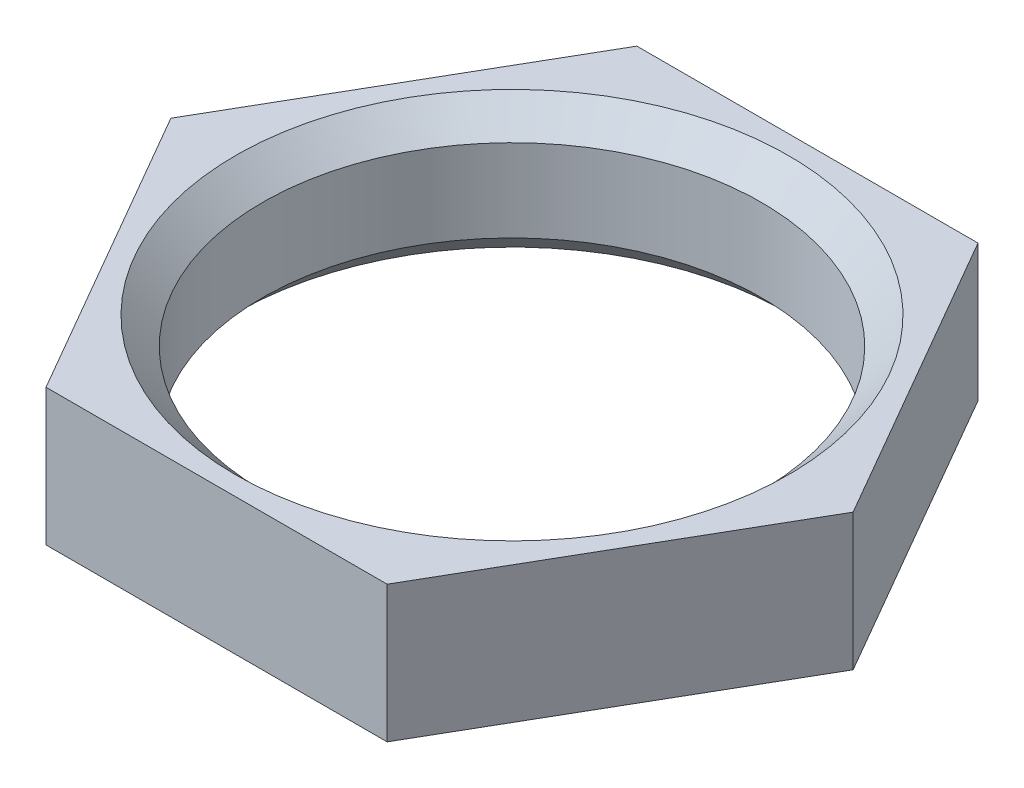
ISO-10303-21;
HEADER;
FILE_DESCRIPTION(('STEP AP214'),'2;1');
FILE_NAME('part.step','',(''),(''),'','','');
FILE_SCHEMA(('AUTOMOTIVE_DESIGN { 1 0 10303 214 1 1 1 1 }'));
ENDSEC;
DATA;
#1=APPLICATION_CONTEXT('core data for automotive mechanical design processes');
#2=APPLICATION_PROTOCOL_DEFINITION('international standard','automotive_design',2000,#1);
#3=PRODUCT_CONTEXT('',#1,'mechanical');
#4=PRODUCT('Part','Part','',(#3));
#5=PRODUCT_RELATED_PRODUCT_CATEGORY('part','',(#4));
#6=PRODUCT_DEFINITION_FORMATION('','',#4);
#7=PRODUCT_DEFINITION_CONTEXT('part definition',#1,'design');
#8=PRODUCT_DEFINITION('design','',#6,#7);
#9=PRODUCT_DEFINITION_SHAPE('','',#8);
#10=(LENGTH_UNIT() NAMED_UNIT(*) SI_UNIT(.MILLI.,.METRE.));
#11=(NAMED_UNIT(*) PLANE_ANGLE_UNIT() SI_UNIT($,.RADIAN.));
#12=(NAMED_UNIT(*) SI_UNIT($,.STERADIAN.) SOLID_ANGLE_UNIT());
#13=UNCERTAINTY_MEASURE_WITH_UNIT(LENGTH_MEASURE(1.E-05),#10,'distance_accuracy_value','');
#14=(GEOMETRIC_REPRESENTATION_CONTEXT(3) GLOBAL_UNCERTAINTY_ASSIGNED_CONTEXT((#13)) GLOBAL_UNIT_ASSIGNED_CONTEXT((#10,
#11,#12)) REPRESENTATION_CONTEXT('',''));
#15=CARTESIAN_POINT('',(0.,0.,0.));
#16=DIRECTION('',(0.,0.,1.));
#17=DIRECTION('',(1.,0.,0.));
#18=AXIS2_PLACEMENT_3D('',#15,#16,#17);
#19=CARTESIAN_POINT('',(3.20423625897551,2.5654,5.5499));
#20=DIRECTION('',(-0.866025403784439,0.,-0.5));
#21=DIRECTION('',(-0.5,0.,0.866025403784439));
#22=AXIS2_PLACEMENT_3D('',#19,#20,#21);
#23=PLANE('',#22);
#24=DIRECTION('',(0.5,0.,-0.866025403784439));
#25=VECTOR('',#24,1.);
#26=CARTESIAN_POINT('',(3.20423625897551,0.,5.5499));
#27=LINE('',#26,#25);
#28=CARTESIAN_POINT('',(3.20423625897551,0.,5.5499));
#29=VERTEX_POINT('',#28);
#30=CARTESIAN_POINT('',(6.40847251795101,0.,0.));
#31=VERTEX_POINT('',#30);
#32=EDGE_CURVE('E124',#29,#31,#27,.T.);
#33=ORIENTED_EDGE('',*,*,#32,.T.);
#34=DIRECTION('',(0.,-1.,0.));
#35=VECTOR('',#34,1.);
#36=CARTESIAN_POINT('',(6.40847251795101,2.5654,0.));
#37=LINE('',#36,#35);
#38=CARTESIAN_POINT('',(6.40847251795101,2.5654,0.));
#39=VERTEX_POINT('',#38);
#40=EDGE_CURVE('E141',#39,#31,#37,.T.);
#41=ORIENTED_EDGE('',*,*,#40,.F.);
#42=DIRECTION('',(0.5,0.,-0.866025403784439));
#43=VECTOR('',#42,1.);
#44=CARTESIAN_POINT('',(3.20423625897551,2.5654,5.5499));
#45=LINE('',#44,#43);
#46=CARTESIAN_POINT('',(3.20423625897551,2.5654,5.5499));
#47=VERTEX_POINT('',#46);
#48=EDGE_CURVE('E134',#47,#39,#45,.T.);
#49=ORIENTED_EDGE('',*,*,#48,.F.);
#50=DIRECTION('',(0.,-1.,0.));
#51=VECTOR('',#50,1.);
#52=CARTESIAN_POINT('',(3.20423625897551,2.5654,5.5499));
#53=LINE('',#52,#51);
#54=EDGE_CURVE('E120',#47,#29,#53,.T.);
#55=ORIENTED_EDGE('',*,*,#54,.T.);
#56=EDGE_LOOP('',(#33,#41,#49,#55));
#57=FACE_BOUND('',#56,.T.);
#58=ADVANCED_FACE('F38',(#57),#23,.F.);
#59=CARTESIAN_POINT('',(6.40847251795101,2.5654,0.));
#60=DIRECTION('',(-0.866025403784439,0.,0.5));
#61=DIRECTION('',(0.5,0.,0.866025403784439));
#62=AXIS2_PLACEMENT_3D('',#59,#60,#61);
#63=PLANE('',#62);
#64=DIRECTION('',(-0.5,0.,-0.866025403784438));
#65=VECTOR('',#64,1.);
#66=CARTESIAN_POINT('',(6.40847251795101,0.,0.));
#67=LINE('',#66,#65);
#68=CARTESIAN_POINT('',(3.2042362589755,0.,-5.5499));
#69=VERTEX_POINT('',#68);
#70=EDGE_CURVE('E127',#31,#69,#67,.T.);
#71=ORIENTED_EDGE('',*,*,#70,.T.);
#72=DIRECTION('',(0.,-1.,0.));
#73=VECTOR('',#72,1.);
#74=CARTESIAN_POINT('',(3.2042362589755,2.5654,-5.5499));
#75=LINE('',#74,#73);
#76=CARTESIAN_POINT('',(3.2042362589755,2.5654,-5.5499));
#77=VERTEX_POINT('',#76);
#78=EDGE_CURVE('E138',#77,#69,#75,.T.);
#79=ORIENTED_EDGE('',*,*,#78,.F.);
#80=DIRECTION('',(-0.5,0.,-0.866025403784438));
#81=VECTOR('',#80,1.);
#82=CARTESIAN_POINT('',(6.40847251795101,2.5654,0.));
#83=LINE('',#82,#81);
#84=EDGE_CURVE('E93',#39,#77,#83,.T.);
#85=ORIENTED_EDGE('',*,*,#84,.F.);
#86=ORIENTED_EDGE('',*,*,#40,.T.);
#87=EDGE_LOOP('',(#71,#79,#85,#86));
#88=FACE_BOUND('',#87,.T.);
#89=ADVANCED_FACE('F164',(#88),#63,.F.);
#90=CARTESIAN_POINT('',(3.2042362589755,2.5654,-5.5499));
#91=DIRECTION('',(0.,0.,1.));
#92=DIRECTION('',(1.,0.,0.));
#93=AXIS2_PLACEMENT_3D('',#90,#91,#92);
#94=PLANE('',#93);
#95=DIRECTION('',(-1.,0.,0.));
#96=VECTOR('',#95,1.);
#97=CARTESIAN_POINT('',(3.2042362589755,0.,-5.5499));
#98=LINE('',#97,#96);
#99=CARTESIAN_POINT('',(-3.20423625897551,0.,-5.5499));
#100=VERTEX_POINT('',#99);
#101=EDGE_CURVE('E129',#69,#100,#98,.T.);
#102=ORIENTED_EDGE('',*,*,#101,.T.);
#103=DIRECTION('',(0.,-1.,0.));
#104=VECTOR('',#103,1.);
#105=CARTESIAN_POINT('',(-3.20423625897551,2.5654,-5.5499));
#106=LINE('',#105,#104);
#107=CARTESIAN_POINT('',(-3.20423625897551,2.5654,-5.5499));
#108=VERTEX_POINT('',#107);
#109=EDGE_CURVE('E115',#108,#100,#106,.T.);
#110=ORIENTED_EDGE('',*,*,#109,.F.);
#111=DIRECTION('',(-1.,0.,0.));
#112=VECTOR('',#111,1.);
#113=CARTESIAN_POINT('',(3.2042362589755,2.5654,-5.5499));
#114=LINE('',#113,#112);
#115=EDGE_CURVE('E106',#77,#108,#114,.T.);
#116=ORIENTED_EDGE('',*,*,#115,.F.);
#117=ORIENTED_EDGE('',*,*,#78,.T.);
#118=EDGE_LOOP('',(#102,#110,#116,#117));
#119=FACE_BOUND('',#118,.T.);
#120=ADVANCED_FACE('F170',(#119),#94,.F.);
#121=CARTESIAN_POINT('',(-3.20423625897551,2.5654,-5.5499));
#122=DIRECTION('',(0.866025403784439,0.,0.5));
#123=DIRECTION('',(0.5,0.,-0.866025403784439));
#124=AXIS2_PLACEMENT_3D('',#121,#122,#123);
#125=PLANE('',#124);
#126=DIRECTION('',(-0.5,0.,0.866025403784439));
#127=VECTOR('',#126,1.);
#128=CARTESIAN_POINT('',(-3.20423625897551,0.,-5.5499));
#129=LINE('',#128,#127);
#130=CARTESIAN_POINT('',(-6.40847251795101,0.,0.));
#131=VERTEX_POINT('',#130);
#132=EDGE_CURVE('E114',#100,#131,#129,.T.);
#133=ORIENTED_EDGE('',*,*,#132,.T.);
#134=DIRECTION('',(0.,-1.,0.));
#135=VECTOR('',#134,1.);
#136=CARTESIAN_POINT('',(-6.40847251795101,2.5654,0.));
#137=LINE('',#136,#135);
#138=CARTESIAN_POINT('',(-6.40847251795101,2.5654,0.));
#139=VERTEX_POINT('',#138);
#140=EDGE_CURVE('E111',#139,#131,#137,.T.);
#141=ORIENTED_EDGE('',*,*,#140,.F.);
#142=DIRECTION('',(-0.5,0.,0.866025403784439));
#143=VECTOR('',#142,1.);
#144=CARTESIAN_POINT('',(-3.20423625897551,2.5654,-5.5499));
#145=LINE('',#144,#143);
#146=EDGE_CURVE('E100',#108,#139,#145,.T.);
#147=ORIENTED_EDGE('',*,*,#146,.F.);
#148=ORIENTED_EDGE('',*,*,#109,.T.);
#149=EDGE_LOOP('',(#133,#141,#147,#148));
#150=FACE_BOUND('',#149,.T.);
#151=ADVANCED_FACE('F112',(#150),#125,.F.);
#152=CARTESIAN_POINT('',(-6.40847251795101,2.5654,0.));
#153=DIRECTION('',(0.866025403784439,0.,-0.5));
#154=DIRECTION('',(-0.5,0.,-0.866025403784439));
#155=AXIS2_PLACEMENT_3D('',#152,#153,#154);
#156=PLANE('',#155);
#157=DIRECTION('',(0.5,0.,0.866025403784438));
#158=VECTOR('',#157,1.);
#159=CARTESIAN_POINT('',(-6.40847251795101,0.,0.));
#160=LINE('',#159,#158);
#161=CARTESIAN_POINT('',(-3.20423625897551,0.,5.5499));
#162=VERTEX_POINT('',#161);
#163=EDGE_CURVE('E78',#131,#162,#160,.T.);
#164=ORIENTED_EDGE('',*,*,#163,.T.);
#165=DIRECTION('',(0.,-1.,0.));
#166=VECTOR('',#165,1.);
#167=CARTESIAN_POINT('',(-3.20423625897551,2.5654,5.5499));
#168=LINE('',#167,#166);
#169=CARTESIAN_POINT('',(-3.20423625897551,2.5654,5.5499));
#170=VERTEX_POINT('',#169);
#171=EDGE_CURVE('E116',#170,#162,#168,.T.);
#172=ORIENTED_EDGE('',*,*,#171,.F.);
#173=DIRECTION('',(0.5,0.,0.866025403784438));
#174=VECTOR('',#173,1.);
#175=CARTESIAN_POINT('',(-6.40847251795101,2.5654,0.));
#176=LINE('',#175,#174);
#177=EDGE_CURVE('E104',#139,#170,#176,.T.);
#178=ORIENTED_EDGE('',*,*,#177,.F.);
#179=ORIENTED_EDGE('',*,*,#140,.T.);
#180=EDGE_LOOP('',(#164,#172,#178,#179));
#181=FACE_BOUND('',#180,.T.);
#182=ADVANCED_FACE('F118',(#181),#156,.F.);
#183=CARTESIAN_POINT('',(-3.20423625897551,2.5654,5.5499));
#184=DIRECTION('',(0.,0.,-1.));
#185=DIRECTION('',(-1.,0.,0.));
#186=AXIS2_PLACEMENT_3D('',#183,#184,#185);
#187=PLANE('',#186);
#188=DIRECTION('',(1.,0.,0.));
#189=VECTOR('',#188,1.);
#190=CARTESIAN_POINT('',(-3.20423625897551,0.,5.5499));
#191=LINE('',#190,#189);
#192=EDGE_CURVE('E84',#162,#29,#191,.T.);
#193=ORIENTED_EDGE('',*,*,#192,.T.);
#194=ORIENTED_EDGE('',*,*,#54,.F.);
#195=DIRECTION('',(1.,0.,0.));
#196=VECTOR('',#195,1.);
#197=CARTESIAN_POINT('',(-3.20423625897551,2.5654,5.5499));
#198=LINE('',#197,#196);
#199=EDGE_CURVE('E55',#170,#47,#198,.T.);
#200=ORIENTED_EDGE('',*,*,#199,.F.);
#201=ORIENTED_EDGE('',*,*,#171,.T.);
#202=EDGE_LOOP('',(#193,#194,#200,#201));
#203=FACE_BOUND('',#202,.T.);
#204=ADVANCED_FACE('F180',(#203),#187,.F.);
#205=CARTESIAN_POINT('',(0.,2.5654,0.));
#206=DIRECTION('',(0.,1.,0.));
#207=DIRECTION('',(0.,0.,1.));
#208=AXIS2_PLACEMENT_3D('',#205,#206,#207);
#209=PLANE('',#208);
#210=CARTESIAN_POINT('',(0.,2.5654,0.));
#211=DIRECTION('',(0.,1.,0.));
#212=DIRECTION('',(0.,0.,1.));
#213=AXIS2_PLACEMENT_3D('',#210,#211,#212);
#214=CIRCLE('',#213,5.1943);
#215=CARTESIAN_POINT('',(0.,2.5654,5.1943));
#216=VERTEX_POINT('',#215);
#217=EDGE_CURVE('E146',#216,#216,#214,.F.);
#218=ORIENTED_EDGE('',*,*,#217,.T.);
#219=EDGE_LOOP('',(#218));
#220=FACE_BOUND('',#219,.T.);
#221=ORIENTED_EDGE('',*,*,#48,.T.);
#222=ORIENTED_EDGE('',*,*,#84,.T.);
#223=ORIENTED_EDGE('',*,*,#115,.T.);
#224=ORIENTED_EDGE('',*,*,#146,.T.);
#225=ORIENTED_EDGE('',*,*,#177,.T.);
#226=ORIENTED_EDGE('',*,*,#199,.T.);
#227=EDGE_LOOP('',(#221,#222,#223,#224,#225,#226));
#228=FACE_BOUND('',#227,.T.);
#229=ADVANCED_FACE('F102',(#220,#228),#209,.T.);
#230=CARTESIAN_POINT('',(0.,0.,0.));
#231=DIRECTION('',(0.,1.,0.));
#232=DIRECTION('',(0.,0.,1.));
#233=AXIS2_PLACEMENT_3D('',#230,#231,#232);
#234=PLANE('',#233);
#235=CARTESIAN_POINT('',(0.,0.,0.));
#236=DIRECTION('',(0.,1.,0.));
#237=DIRECTION('',(0.,0.,1.));
#238=AXIS2_PLACEMENT_3D('',#235,#236,#237);
#239=CIRCLE('',#238,5.1943);
#240=CARTESIAN_POINT('',(0.,0.,5.1943));
#241=VERTEX_POINT('',#240);
#242=EDGE_CURVE('E47',#241,#241,#239,.T.);
#243=ORIENTED_EDGE('',*,*,#242,.T.);
#244=EDGE_LOOP('',(#243));
#245=FACE_BOUND('',#244,.T.);
#246=ORIENTED_EDGE('',*,*,#32,.F.);
#247=ORIENTED_EDGE('',*,*,#192,.F.);
#248=ORIENTED_EDGE('',*,*,#163,.F.);
#249=ORIENTED_EDGE('',*,*,#132,.F.);
#250=ORIENTED_EDGE('',*,*,#101,.F.);
#251=ORIENTED_EDGE('',*,*,#70,.F.);
#252=EDGE_LOOP('',(#246,#247,#248,#249,#250,#251));
#253=FACE_BOUND('',#252,.T.);
#254=ADVANCED_FACE('F151',(#245,#253),#234,.F.);
#255=CARTESIAN_POINT('',(0.,0.,0.));
#256=DIRECTION('',(0.,1.,0.));
#257=DIRECTION('',(0.,0.,1.));
#258=AXIS2_PLACEMENT_3D('',#255,#256,#257);
#259=CYLINDRICAL_SURFACE('',#258,4.6863);
#260=CARTESIAN_POINT('',(0.,0.508,0.));
#261=DIRECTION('',(0.,1.,0.));
#262=DIRECTION('',(0.,0.,1.));
#263=AXIS2_PLACEMENT_3D('',#260,#261,#262);
#264=CIRCLE('',#263,4.6863);
#265=CARTESIAN_POINT('',(0.,0.508,4.6863));
#266=VERTEX_POINT('',#265);
#267=EDGE_CURVE('E13',#266,#266,#264,.F.);
#268=ORIENTED_EDGE('',*,*,#267,.T.);
#269=EDGE_LOOP('',(#268));
#270=FACE_BOUND('',#269,.T.);
#271=CARTESIAN_POINT('',(0.,2.0574,0.));
#272=DIRECTION('',(0.,1.,0.));
#273=DIRECTION('',(0.,0.,1.));
#274=AXIS2_PLACEMENT_3D('',#271,#272,#273);
#275=CIRCLE('',#274,4.6863);
#276=CARTESIAN_POINT('',(0.,2.0574,4.6863));
#277=VERTEX_POINT('',#276);
#278=EDGE_CURVE('E143',#277,#277,#275,.T.);
#279=ORIENTED_EDGE('',*,*,#278,.T.);
#280=EDGE_LOOP('',(#279));
#281=FACE_BOUND('',#280,.T.);
#282=ADVANCED_FACE('F160',(#270,#281),#259,.F.);
#283=CARTESIAN_POINT('',(0.,2.0574,0.));
#284=DIRECTION('',(0.,1.,0.));
#285=DIRECTION('',(0.,0.,1.));
#286=AXIS2_PLACEMENT_3D('',#283,#284,#285);
#287=CONICAL_SURFACE('',#286,4.6863,0.785398163397448);
#288=ORIENTED_EDGE('',*,*,#217,.F.);
#289=EDGE_LOOP('',(#288));
#290=FACE_BOUND('',#289,.T.);
#291=ORIENTED_EDGE('',*,*,#278,.F.);
#292=EDGE_LOOP('',(#291));
#293=FACE_BOUND('',#292,.T.);
#294=ADVANCED_FACE('F155',(#290,#293),#287,.F.);
#295=CARTESIAN_POINT('',(0.,0.,0.));
#296=DIRECTION('',(0.,-1.,0.));
#297=DIRECTION('',(0.,0.,-1.));
#298=AXIS2_PLACEMENT_3D('',#295,#296,#297);
#299=CONICAL_SURFACE('',#298,5.1943,0.785398163397448);
#300=ORIENTED_EDGE('',*,*,#267,.F.);
#301=EDGE_LOOP('',(#300));
#302=FACE_BOUND('',#301,.T.);
#303=ORIENTED_EDGE('',*,*,#242,.F.);
#304=EDGE_LOOP('',(#303));
#305=FACE_BOUND('',#304,.T.);
#306=ADVANCED_FACE('F40',(#302,#305),#299,.F.);
#307=CLOSED_SHELL('',(#58,#89,#120,#151,#182,#204,#229,#254,#282,#294,#306));
#308=MANIFOLD_SOLID_BREP('B2',#307);
#309=ADVANCED_BREP_SHAPE_REPRESENTATION('',(#18,#308),#14);
#310=SHAPE_DEFINITION_REPRESENTATION(#9,#309);
ENDSEC;
END-ISO-10303-21;
